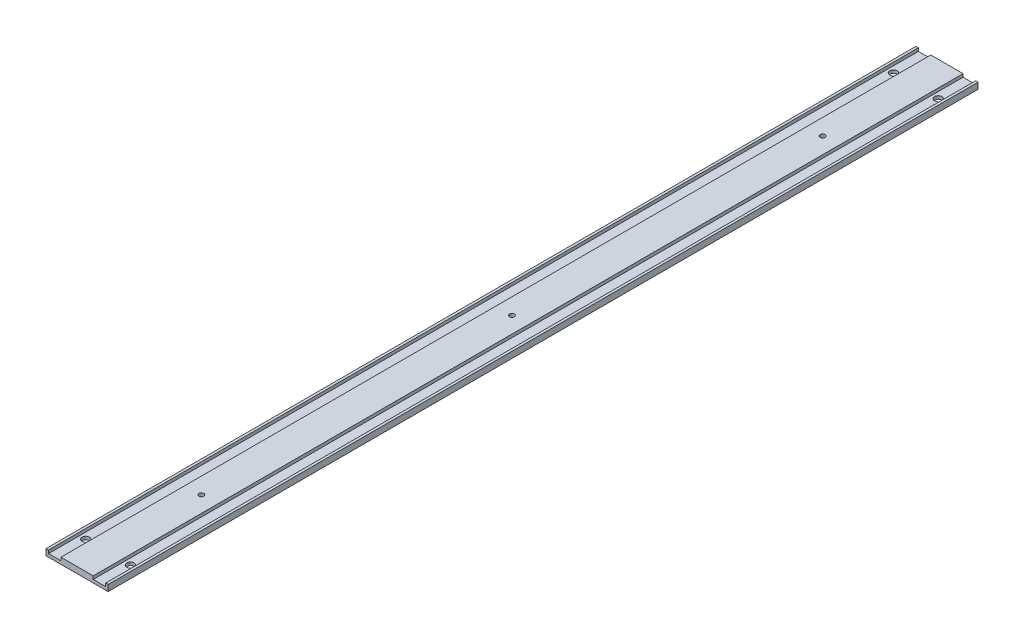
ISO-10303-21;
HEADER;
FILE_DESCRIPTION(('STEP AP214'),'2;1');
FILE_NAME('part.step','',(''),(''),'','','');
FILE_SCHEMA(('AUTOMOTIVE_DESIGN { 1 0 10303 214 1 1 1 1 }'));
ENDSEC;
DATA;
#1=APPLICATION_CONTEXT('core data for automotive mechanical design processes');
#2=APPLICATION_PROTOCOL_DEFINITION('international standard','automotive_design',2000,#1);
#3=PRODUCT_CONTEXT('',#1,'mechanical');
#4=PRODUCT('Part','Part','',(#3));
#5=PRODUCT_RELATED_PRODUCT_CATEGORY('part','',(#4));
#6=PRODUCT_DEFINITION_FORMATION('','',#4);
#7=PRODUCT_DEFINITION_CONTEXT('part definition',#1,'design');
#8=PRODUCT_DEFINITION('design','',#6,#7);
#9=PRODUCT_DEFINITION_SHAPE('','',#8);
#10=(LENGTH_UNIT() NAMED_UNIT(*) SI_UNIT(.MILLI.,.METRE.));
#11=(NAMED_UNIT(*) PLANE_ANGLE_UNIT() SI_UNIT($,.RADIAN.));
#12=(NAMED_UNIT(*) SI_UNIT($,.STERADIAN.) SOLID_ANGLE_UNIT());
#13=UNCERTAINTY_MEASURE_WITH_UNIT(LENGTH_MEASURE(1.E-05),#10,'distance_accuracy_value','');
#14=(GEOMETRIC_REPRESENTATION_CONTEXT(3) GLOBAL_UNCERTAINTY_ASSIGNED_CONTEXT((#13)) GLOBAL_UNIT_ASSIGNED_CONTEXT((#10,
#11,#12)) REPRESENTATION_CONTEXT('',''));
#15=CARTESIAN_POINT('',(0.,0.,0.));
#16=DIRECTION('',(0.,0.,1.));
#17=DIRECTION('',(1.,0.,0.));
#18=AXIS2_PLACEMENT_3D('',#15,#16,#17);
#19=CARTESIAN_POINT('',(0.,5.,0.));
#20=DIRECTION('',(0.,1.,0.));
#21=DIRECTION('',(0.,0.,1.));
#22=AXIS2_PLACEMENT_3D('',#19,#20,#21);
#23=PLANE('',#22);
#24=DIRECTION('',(0.,0.,-1.));
#25=VECTOR('',#24,1.);
#26=CARTESIAN_POINT('',(12.,5.,0.));
#27=LINE('',#26,#25);
#28=CARTESIAN_POINT('',(12.,5.,0.));
#29=VERTEX_POINT('',#28);
#30=CARTESIAN_POINT('',(12.,5.,-700.));
#31=VERTEX_POINT('',#30);
#32=EDGE_CURVE('E135',#29,#31,#27,.T.);
#33=ORIENTED_EDGE('',*,*,#32,.F.);
#34=DIRECTION('',(1.,0.,0.));
#35=VECTOR('',#34,1.);
#36=CARTESIAN_POINT('',(0.,5.,0.));
#37=LINE('',#36,#35);
#38=CARTESIAN_POINT('',(38.,5.,0.));
#39=VERTEX_POINT('',#38);
#40=EDGE_CURVE('E248',#29,#39,#37,.T.);
#41=ORIENTED_EDGE('',*,*,#40,.T.);
#42=DIRECTION('',(0.,0.,1.));
#43=VECTOR('',#42,1.);
#44=CARTESIAN_POINT('',(38.,5.,-700.));
#45=LINE('',#44,#43);
#46=CARTESIAN_POINT('',(38.,5.,-700.));
#47=VERTEX_POINT('',#46);
#48=EDGE_CURVE('E197',#47,#39,#45,.T.);
#49=ORIENTED_EDGE('',*,*,#48,.F.);
#50=DIRECTION('',(-1.,0.,0.));
#51=VECTOR('',#50,1.);
#52=CARTESIAN_POINT('',(50.,5.,-700.));
#53=LINE('',#52,#51);
#54=EDGE_CURVE('E257',#47,#31,#53,.T.);
#55=ORIENTED_EDGE('',*,*,#54,.T.);
#56=EDGE_LOOP('',(#33,#41,#49,#55));
#57=FACE_BOUND('',#56,.T.);
#58=CARTESIAN_POINT('',(25.,5.,-600.));
#59=DIRECTION('',(0.,1.,0.));
#60=DIRECTION('',(0.,0.,1.));
#61=AXIS2_PLACEMENT_3D('',#58,#59,#60);
#62=CIRCLE('',#61,2.);
#63=CARTESIAN_POINT('',(25.,5.,-598.));
#64=VERTEX_POINT('',#63);
#65=EDGE_CURVE('E218',#64,#64,#62,.T.);
#66=ORIENTED_EDGE('',*,*,#65,.F.);
#67=EDGE_LOOP('',(#66));
#68=FACE_BOUND('',#67,.T.);
#69=CARTESIAN_POINT('',(25.,5.,-350.));
#70=DIRECTION('',(0.,1.,0.));
#71=DIRECTION('',(0.,0.,1.));
#72=AXIS2_PLACEMENT_3D('',#69,#70,#71);
#73=CIRCLE('',#72,2.);
#74=CARTESIAN_POINT('',(25.,5.,-348.));
#75=VERTEX_POINT('',#74);
#76=EDGE_CURVE('E226',#75,#75,#73,.T.);
#77=ORIENTED_EDGE('',*,*,#76,.F.);
#78=EDGE_LOOP('',(#77));
#79=FACE_BOUND('',#78,.T.);
#80=CARTESIAN_POINT('',(25.,5.,-100.));
#81=DIRECTION('',(0.,1.,0.));
#82=DIRECTION('',(0.,0.,1.));
#83=AXIS2_PLACEMENT_3D('',#80,#81,#82);
#84=CIRCLE('',#83,2.);
#85=CARTESIAN_POINT('',(25.,5.,-98.));
#86=VERTEX_POINT('',#85);
#87=EDGE_CURVE('E172',#86,#86,#84,.T.);
#88=ORIENTED_EDGE('',*,*,#87,.F.);
#89=EDGE_LOOP('',(#88));
#90=FACE_BOUND('',#89,.T.);
#91=ADVANCED_FACE('F38',(#57,#68,#79,#90),#23,.T.);
#92=DIRECTION('',(0.,0.,1.));
#93=VECTOR('',#92,1.);
#94=CARTESIAN_POINT('',(2.,5.,-700.));
#95=LINE('',#94,#93);
#96=CARTESIAN_POINT('',(2.,5.,-700.));
#97=VERTEX_POINT('',#96);
#98=CARTESIAN_POINT('',(2.,5.,0.));
#99=VERTEX_POINT('',#98);
#100=EDGE_CURVE('E151',#97,#99,#95,.T.);
#101=ORIENTED_EDGE('',*,*,#100,.F.);
#102=CARTESIAN_POINT('',(0.,5.,-700.));
#103=VERTEX_POINT('',#102);
#104=EDGE_CURVE('E251',#97,#103,#53,.T.);
#105=ORIENTED_EDGE('',*,*,#104,.T.);
#106=DIRECTION('',(0.,0.,1.));
#107=VECTOR('',#106,1.);
#108=CARTESIAN_POINT('',(0.,5.,-700.));
#109=LINE('',#108,#107);
#110=CARTESIAN_POINT('',(0.,5.,0.));
#111=VERTEX_POINT('',#110);
#112=EDGE_CURVE('E237',#103,#111,#109,.T.);
#113=ORIENTED_EDGE('',*,*,#112,.T.);
#114=EDGE_CURVE('E243',#111,#99,#37,.T.);
#115=ORIENTED_EDGE('',*,*,#114,.T.);
#116=EDGE_LOOP('',(#101,#105,#113,#115));
#117=FACE_BOUND('',#116,.T.);
#118=ADVANCED_FACE('F323',(#117),#23,.T.);
#119=CARTESIAN_POINT('',(0.,5.,-700.));
#120=DIRECTION('',(1.,0.,0.));
#121=DIRECTION('',(0.,0.,-1.));
#122=AXIS2_PLACEMENT_3D('',#119,#120,#121);
#123=PLANE('',#122);
#124=DIRECTION('',(0.,0.,1.));
#125=VECTOR('',#124,1.);
#126=CARTESIAN_POINT('',(0.,0.,-700.));
#127=LINE('',#126,#125);
#128=CARTESIAN_POINT('',(0.,0.,-700.));
#129=VERTEX_POINT('',#128);
#130=CARTESIAN_POINT('',(0.,0.,0.));
#131=VERTEX_POINT('',#130);
#132=EDGE_CURVE('E217',#129,#131,#127,.T.);
#133=ORIENTED_EDGE('',*,*,#132,.T.);
#134=DIRECTION('',(0.,-1.,0.));
#135=VECTOR('',#134,1.);
#136=CARTESIAN_POINT('',(0.,5.,0.));
#137=LINE('',#136,#135);
#138=EDGE_CURVE('E11',#111,#131,#137,.T.);
#139=ORIENTED_EDGE('',*,*,#138,.F.);
#140=ORIENTED_EDGE('',*,*,#112,.F.);
#141=DIRECTION('',(0.,-1.,0.));
#142=VECTOR('',#141,1.);
#143=CARTESIAN_POINT('',(0.,5.,-700.));
#144=LINE('',#143,#142);
#145=EDGE_CURVE('E256',#103,#129,#144,.T.);
#146=ORIENTED_EDGE('',*,*,#145,.T.);
#147=EDGE_LOOP('',(#133,#139,#140,#146));
#148=FACE_BOUND('',#147,.T.);
#149=ADVANCED_FACE('F40',(#148),#123,.F.);
#150=CARTESIAN_POINT('',(0.,5.,0.));
#151=DIRECTION('',(0.,0.,-1.));
#152=DIRECTION('',(-1.,0.,0.));
#153=AXIS2_PLACEMENT_3D('',#150,#151,#152);
#154=PLANE('',#153);
#155=ORIENTED_EDGE('',*,*,#40,.F.);
#156=DIRECTION('',(0.,1.,0.));
#157=VECTOR('',#156,1.);
#158=CARTESIAN_POINT('',(12.,2.5,0.));
#159=LINE('',#158,#157);
#160=CARTESIAN_POINT('',(12.,2.5,0.));
#161=VERTEX_POINT('',#160);
#162=EDGE_CURVE('E169',#161,#29,#159,.T.);
#163=ORIENTED_EDGE('',*,*,#162,.F.);
#164=DIRECTION('',(1.,0.,0.));
#165=VECTOR('',#164,1.);
#166=CARTESIAN_POINT('',(12.,2.5,0.));
#167=LINE('',#166,#165);
#168=CARTESIAN_POINT('',(2.,2.5,0.));
#169=VERTEX_POINT('',#168);
#170=EDGE_CURVE('E141',#169,#161,#167,.T.);
#171=ORIENTED_EDGE('',*,*,#170,.F.);
#172=DIRECTION('',(0.,1.,0.));
#173=VECTOR('',#172,1.);
#174=CARTESIAN_POINT('',(2.,2.5,0.));
#175=LINE('',#174,#173);
#176=EDGE_CURVE('E173',#169,#99,#175,.T.);
#177=ORIENTED_EDGE('',*,*,#176,.T.);
#178=ORIENTED_EDGE('',*,*,#114,.F.);
#179=ORIENTED_EDGE('',*,*,#138,.T.);
#180=DIRECTION('',(1.,0.,0.));
#181=VECTOR('',#180,1.);
#182=CARTESIAN_POINT('',(0.,0.,0.));
#183=LINE('',#182,#181);
#184=CARTESIAN_POINT('',(50.,0.,0.));
#185=VERTEX_POINT('',#184);
#186=EDGE_CURVE('E261',#131,#185,#183,.T.);
#187=ORIENTED_EDGE('',*,*,#186,.T.);
#188=DIRECTION('',(0.,-1.,0.));
#189=VECTOR('',#188,1.);
#190=CARTESIAN_POINT('',(50.,5.,0.));
#191=LINE('',#190,#189);
#192=CARTESIAN_POINT('',(50.,5.,0.));
#193=VERTEX_POINT('',#192);
#194=EDGE_CURVE('E48',#193,#185,#191,.T.);
#195=ORIENTED_EDGE('',*,*,#194,.F.);
#196=CARTESIAN_POINT('',(48.,5.,0.));
#197=VERTEX_POINT('',#196);
#198=EDGE_CURVE('E241',#197,#193,#37,.T.);
#199=ORIENTED_EDGE('',*,*,#198,.F.);
#200=DIRECTION('',(0.,1.,0.));
#201=VECTOR('',#200,1.);
#202=CARTESIAN_POINT('',(48.,2.5,0.));
#203=LINE('',#202,#201);
#204=CARTESIAN_POINT('',(48.,2.5,0.));
#205=VERTEX_POINT('',#204);
#206=EDGE_CURVE('E64',#205,#197,#203,.T.);
#207=ORIENTED_EDGE('',*,*,#206,.F.);
#208=DIRECTION('',(1.,0.,0.));
#209=VECTOR('',#208,1.);
#210=CARTESIAN_POINT('',(38.,2.5,0.));
#211=LINE('',#210,#209);
#212=CARTESIAN_POINT('',(38.,2.5,0.));
#213=VERTEX_POINT('',#212);
#214=EDGE_CURVE('E183',#213,#205,#211,.T.);
#215=ORIENTED_EDGE('',*,*,#214,.F.);
#216=DIRECTION('',(0.,1.,0.));
#217=VECTOR('',#216,1.);
#218=CARTESIAN_POINT('',(38.,2.5,0.));
#219=LINE('',#218,#217);
#220=EDGE_CURVE('E196',#213,#39,#219,.T.);
#221=ORIENTED_EDGE('',*,*,#220,.T.);
#222=EDGE_LOOP('',(#155,#163,#171,#177,#178,#179,#187,#195,#199,#207,#215,#221));
#223=FACE_BOUND('',#222,.T.);
#224=ADVANCED_FACE('F311',(#223),#154,.F.);
#225=CARTESIAN_POINT('',(50.,5.,0.));
#226=DIRECTION('',(-1.,0.,0.));
#227=DIRECTION('',(0.,0.,1.));
#228=AXIS2_PLACEMENT_3D('',#225,#226,#227);
#229=PLANE('',#228);
#230=DIRECTION('',(0.,0.,-1.));
#231=VECTOR('',#230,1.);
#232=CARTESIAN_POINT('',(50.,0.,0.));
#233=LINE('',#232,#231);
#234=CARTESIAN_POINT('',(50.,0.,-700.));
#235=VERTEX_POINT('',#234);
#236=EDGE_CURVE('E264',#185,#235,#233,.T.);
#237=ORIENTED_EDGE('',*,*,#236,.T.);
#238=DIRECTION('',(0.,-1.,0.));
#239=VECTOR('',#238,1.);
#240=CARTESIAN_POINT('',(50.,5.,-700.));
#241=LINE('',#240,#239);
#242=CARTESIAN_POINT('',(50.,5.,-700.));
#243=VERTEX_POINT('',#242);
#244=EDGE_CURVE('E272',#243,#235,#241,.T.);
#245=ORIENTED_EDGE('',*,*,#244,.F.);
#246=DIRECTION('',(0.,0.,-1.));
#247=VECTOR('',#246,1.);
#248=CARTESIAN_POINT('',(50.,5.,0.));
#249=LINE('',#248,#247);
#250=EDGE_CURVE('E247',#193,#243,#249,.T.);
#251=ORIENTED_EDGE('',*,*,#250,.F.);
#252=ORIENTED_EDGE('',*,*,#194,.T.);
#253=EDGE_LOOP('',(#237,#245,#251,#252));
#254=FACE_BOUND('',#253,.T.);
#255=ADVANCED_FACE('F332',(#254),#229,.F.);
#256=CARTESIAN_POINT('',(50.,5.,-700.));
#257=DIRECTION('',(0.,0.,1.));
#258=DIRECTION('',(1.,0.,0.));
#259=AXIS2_PLACEMENT_3D('',#256,#257,#258);
#260=PLANE('',#259);
#261=DIRECTION('',(-1.,0.,0.));
#262=VECTOR('',#261,1.);
#263=CARTESIAN_POINT('',(2.,2.5,-700.));
#264=LINE('',#263,#262);
#265=CARTESIAN_POINT('',(12.,2.5,-700.));
#266=VERTEX_POINT('',#265);
#267=CARTESIAN_POINT('',(2.,2.5,-700.));
#268=VERTEX_POINT('',#267);
#269=EDGE_CURVE('E147',#266,#268,#264,.T.);
#270=ORIENTED_EDGE('',*,*,#269,.F.);
#271=DIRECTION('',(0.,1.,0.));
#272=VECTOR('',#271,1.);
#273=CARTESIAN_POINT('',(12.,2.5,-700.));
#274=LINE('',#273,#272);
#275=EDGE_CURVE('E129',#266,#31,#274,.T.);
#276=ORIENTED_EDGE('',*,*,#275,.T.);
#277=ORIENTED_EDGE('',*,*,#54,.F.);
#278=DIRECTION('',(0.,1.,0.));
#279=VECTOR('',#278,1.);
#280=CARTESIAN_POINT('',(38.,2.5,-700.));
#281=LINE('',#280,#279);
#282=CARTESIAN_POINT('',(38.,2.5,-700.));
#283=VERTEX_POINT('',#282);
#284=EDGE_CURVE('E166',#283,#47,#281,.T.);
#285=ORIENTED_EDGE('',*,*,#284,.F.);
#286=DIRECTION('',(-1.,0.,0.));
#287=VECTOR('',#286,1.);
#288=CARTESIAN_POINT('',(38.,2.5,-700.));
#289=LINE('',#288,#287);
#290=CARTESIAN_POINT('',(48.,2.5,-700.));
#291=VERTEX_POINT('',#290);
#292=EDGE_CURVE('E192',#291,#283,#289,.T.);
#293=ORIENTED_EDGE('',*,*,#292,.F.);
#294=DIRECTION('',(0.,1.,0.));
#295=VECTOR('',#294,1.);
#296=CARTESIAN_POINT('',(48.,2.5,-700.));
#297=LINE('',#296,#295);
#298=CARTESIAN_POINT('',(48.,5.,-700.));
#299=VERTEX_POINT('',#298);
#300=EDGE_CURVE('E204',#291,#299,#297,.T.);
#301=ORIENTED_EDGE('',*,*,#300,.T.);
#302=EDGE_CURVE('E252',#243,#299,#53,.T.);
#303=ORIENTED_EDGE('',*,*,#302,.F.);
#304=ORIENTED_EDGE('',*,*,#244,.T.);
#305=DIRECTION('',(-1.,0.,0.));
#306=VECTOR('',#305,1.);
#307=CARTESIAN_POINT('',(50.,0.,-700.));
#308=LINE('',#307,#306);
#309=EDGE_CURVE('E242',#235,#129,#308,.T.);
#310=ORIENTED_EDGE('',*,*,#309,.T.);
#311=ORIENTED_EDGE('',*,*,#145,.F.);
#312=ORIENTED_EDGE('',*,*,#104,.F.);
#313=DIRECTION('',(0.,1.,0.));
#314=VECTOR('',#313,1.);
#315=CARTESIAN_POINT('',(2.,2.5,-700.));
#316=LINE('',#315,#314);
#317=EDGE_CURVE('E56',#268,#97,#316,.T.);
#318=ORIENTED_EDGE('',*,*,#317,.F.);
#319=EDGE_LOOP('',(#270,#276,#277,#285,#293,#301,#303,#304,#310,#311,#312,#318));
#320=FACE_BOUND('',#319,.T.);
#321=ADVANCED_FACE('F153',(#320),#260,.F.);
#322=DIRECTION('',(0.,0.,-1.));
#323=VECTOR('',#322,1.);
#324=CARTESIAN_POINT('',(48.,5.,0.));
#325=LINE('',#324,#323);
#326=EDGE_CURVE('E184',#197,#299,#325,.T.);
#327=ORIENTED_EDGE('',*,*,#326,.F.);
#328=ORIENTED_EDGE('',*,*,#198,.T.);
#329=ORIENTED_EDGE('',*,*,#250,.T.);
#330=ORIENTED_EDGE('',*,*,#302,.T.);
#331=EDGE_LOOP('',(#327,#328,#329,#330));
#332=FACE_BOUND('',#331,.T.);
#333=ADVANCED_FACE('F337',(#332),#23,.T.);
#334=CARTESIAN_POINT('',(0.,0.,0.));
#335=DIRECTION('',(0.,1.,0.));
#336=DIRECTION('',(0.,0.,1.));
#337=AXIS2_PLACEMENT_3D('',#334,#335,#336);
#338=PLANE('',#337);
#339=CARTESIAN_POINT('',(7.,0.,-25.));
#340=DIRECTION('',(0.,1.,0.));
#341=DIRECTION('',(0.,0.,1.));
#342=AXIS2_PLACEMENT_3D('',#339,#340,#341);
#343=CIRCLE('',#342,3.);
#344=CARTESIAN_POINT('',(7.,0.,-22.));
#345=VERTEX_POINT('',#344);
#346=EDGE_CURVE('E486',#345,#345,#343,.T.);
#347=ORIENTED_EDGE('',*,*,#346,.T.);
#348=EDGE_LOOP('',(#347));
#349=FACE_BOUND('',#348,.T.);
#350=CARTESIAN_POINT('',(43.,0.,-675.));
#351=DIRECTION('',(0.,1.,0.));
#352=DIRECTION('',(0.,0.,1.));
#353=AXIS2_PLACEMENT_3D('',#350,#351,#352);
#354=CIRCLE('',#353,3.);
#355=CARTESIAN_POINT('',(43.,0.,-672.));
#356=VERTEX_POINT('',#355);
#357=EDGE_CURVE('E489',#356,#356,#354,.T.);
#358=ORIENTED_EDGE('',*,*,#357,.T.);
#359=EDGE_LOOP('',(#358));
#360=FACE_BOUND('',#359,.T.);
#361=CARTESIAN_POINT('',(7.,0.,-675.));
#362=DIRECTION('',(0.,1.,0.));
#363=DIRECTION('',(0.,0.,1.));
#364=AXIS2_PLACEMENT_3D('',#361,#362,#363);
#365=CIRCLE('',#364,3.);
#366=CARTESIAN_POINT('',(7.,0.,-672.));
#367=VERTEX_POINT('',#366);
#368=EDGE_CURVE('E494',#367,#367,#365,.T.);
#369=ORIENTED_EDGE('',*,*,#368,.T.);
#370=EDGE_LOOP('',(#369));
#371=FACE_BOUND('',#370,.T.);
#372=CARTESIAN_POINT('',(43.,0.,-25.));
#373=DIRECTION('',(0.,1.,0.));
#374=DIRECTION('',(0.,0.,1.));
#375=AXIS2_PLACEMENT_3D('',#372,#373,#374);
#376=CIRCLE('',#375,3.);
#377=CARTESIAN_POINT('',(43.,0.,-22.));
#378=VERTEX_POINT('',#377);
#379=EDGE_CURVE('E284',#378,#378,#376,.T.);
#380=ORIENTED_EDGE('',*,*,#379,.T.);
#381=EDGE_LOOP('',(#380));
#382=FACE_BOUND('',#381,.T.);
#383=CARTESIAN_POINT('',(25.,0.,-600.));
#384=DIRECTION('',(0.,1.,0.));
#385=DIRECTION('',(0.,0.,1.));
#386=AXIS2_PLACEMENT_3D('',#383,#384,#385);
#387=CIRCLE('',#386,2.);
#388=CARTESIAN_POINT('',(25.,0.,-598.));
#389=VERTEX_POINT('',#388);
#390=EDGE_CURVE('E213',#389,#389,#387,.T.);
#391=ORIENTED_EDGE('',*,*,#390,.T.);
#392=EDGE_LOOP('',(#391));
#393=FACE_BOUND('',#392,.T.);
#394=CARTESIAN_POINT('',(25.,0.,-350.));
#395=DIRECTION('',(0.,1.,0.));
#396=DIRECTION('',(0.,0.,1.));
#397=AXIS2_PLACEMENT_3D('',#394,#395,#396);
#398=CIRCLE('',#397,2.);
#399=CARTESIAN_POINT('',(25.,0.,-348.));
#400=VERTEX_POINT('',#399);
#401=EDGE_CURVE('E222',#400,#400,#398,.T.);
#402=ORIENTED_EDGE('',*,*,#401,.T.);
#403=EDGE_LOOP('',(#402));
#404=FACE_BOUND('',#403,.T.);
#405=CARTESIAN_POINT('',(25.,0.,-100.));
#406=DIRECTION('',(0.,1.,0.));
#407=DIRECTION('',(0.,0.,1.));
#408=AXIS2_PLACEMENT_3D('',#405,#406,#407);
#409=CIRCLE('',#408,2.);
#410=CARTESIAN_POINT('',(25.,0.,-98.));
#411=VERTEX_POINT('',#410);
#412=EDGE_CURVE('E230',#411,#411,#409,.T.);
#413=ORIENTED_EDGE('',*,*,#412,.T.);
#414=EDGE_LOOP('',(#413));
#415=FACE_BOUND('',#414,.T.);
#416=ORIENTED_EDGE('',*,*,#132,.F.);
#417=ORIENTED_EDGE('',*,*,#309,.F.);
#418=ORIENTED_EDGE('',*,*,#236,.F.);
#419=ORIENTED_EDGE('',*,*,#186,.F.);
#420=EDGE_LOOP('',(#416,#417,#418,#419));
#421=FACE_BOUND('',#420,.T.);
#422=ADVANCED_FACE('F335',(#349,#360,#371,#382,#393,#404,#415,#421),#338,.F.);
#423=CARTESIAN_POINT('',(25.,0.,-100.));
#424=DIRECTION('',(0.,1.,0.));
#425=DIRECTION('',(0.,0.,1.));
#426=AXIS2_PLACEMENT_3D('',#423,#424,#425);
#427=CYLINDRICAL_SURFACE('',#426,2.);
#428=ORIENTED_EDGE('',*,*,#412,.F.);
#429=EDGE_LOOP('',(#428));
#430=FACE_BOUND('',#429,.T.);
#431=ORIENTED_EDGE('',*,*,#87,.T.);
#432=EDGE_LOOP('',(#431));
#433=FACE_BOUND('',#432,.T.);
#434=ADVANCED_FACE('F363',(#430,#433),#427,.F.);
#435=CARTESIAN_POINT('',(25.,0.,-350.));
#436=DIRECTION('',(0.,1.,0.));
#437=DIRECTION('',(0.,0.,1.));
#438=AXIS2_PLACEMENT_3D('',#435,#436,#437);
#439=CYLINDRICAL_SURFACE('',#438,2.);
#440=ORIENTED_EDGE('',*,*,#401,.F.);
#441=EDGE_LOOP('',(#440));
#442=FACE_BOUND('',#441,.T.);
#443=ORIENTED_EDGE('',*,*,#76,.T.);
#444=EDGE_LOOP('',(#443));
#445=FACE_BOUND('',#444,.T.);
#446=ADVANCED_FACE('F347',(#442,#445),#439,.F.);
#447=CARTESIAN_POINT('',(25.,0.,-600.));
#448=DIRECTION('',(0.,1.,0.));
#449=DIRECTION('',(0.,0.,1.));
#450=AXIS2_PLACEMENT_3D('',#447,#448,#449);
#451=CYLINDRICAL_SURFACE('',#450,2.);
#452=ORIENTED_EDGE('',*,*,#390,.F.);
#453=EDGE_LOOP('',(#452));
#454=FACE_BOUND('',#453,.T.);
#455=ORIENTED_EDGE('',*,*,#65,.T.);
#456=EDGE_LOOP('',(#455));
#457=FACE_BOUND('',#456,.T.);
#458=ADVANCED_FACE('F340',(#454,#457),#451,.F.);
#459=CARTESIAN_POINT('',(38.,2.5,-700.));
#460=DIRECTION('',(-1.,0.,0.));
#461=DIRECTION('',(0.,0.,1.));
#462=AXIS2_PLACEMENT_3D('',#459,#460,#461);
#463=PLANE('',#462);
#464=ORIENTED_EDGE('',*,*,#48,.T.);
#465=ORIENTED_EDGE('',*,*,#220,.F.);
#466=DIRECTION('',(0.,0.,1.));
#467=VECTOR('',#466,1.);
#468=CARTESIAN_POINT('',(38.,2.5,-700.));
#469=LINE('',#468,#467);
#470=EDGE_CURVE('E179',#283,#213,#469,.T.);
#471=ORIENTED_EDGE('',*,*,#470,.F.);
#472=ORIENTED_EDGE('',*,*,#284,.T.);
#473=EDGE_LOOP('',(#464,#465,#471,#472));
#474=FACE_BOUND('',#473,.T.);
#475=ADVANCED_FACE('F338',(#474),#463,.F.);
#476=CARTESIAN_POINT('',(48.,2.5,0.));
#477=DIRECTION('',(1.,0.,0.));
#478=DIRECTION('',(0.,0.,-1.));
#479=AXIS2_PLACEMENT_3D('',#476,#477,#478);
#480=PLANE('',#479);
#481=ORIENTED_EDGE('',*,*,#326,.T.);
#482=ORIENTED_EDGE('',*,*,#300,.F.);
#483=DIRECTION('',(0.,0.,-1.));
#484=VECTOR('',#483,1.);
#485=CARTESIAN_POINT('',(48.,2.5,0.));
#486=LINE('',#485,#484);
#487=EDGE_CURVE('E188',#205,#291,#486,.T.);
#488=ORIENTED_EDGE('',*,*,#487,.F.);
#489=ORIENTED_EDGE('',*,*,#206,.T.);
#490=EDGE_LOOP('',(#481,#482,#488,#489));
#491=FACE_BOUND('',#490,.T.);
#492=ADVANCED_FACE('F302',(#491),#480,.F.);
#493=CARTESIAN_POINT('',(0.,2.5,0.));
#494=DIRECTION('',(0.,1.,0.));
#495=DIRECTION('',(0.,0.,1.));
#496=AXIS2_PLACEMENT_3D('',#493,#494,#495);
#497=PLANE('',#496);
#498=CARTESIAN_POINT('',(43.,2.5,-675.));
#499=DIRECTION('',(0.,1.,0.));
#500=DIRECTION('',(0.,0.,1.));
#501=AXIS2_PLACEMENT_3D('',#498,#499,#500);
#502=CIRCLE('',#501,3.);
#503=CARTESIAN_POINT('',(43.,2.5,-672.));
#504=VERTEX_POINT('',#503);
#505=EDGE_CURVE('E42',#504,#504,#502,.T.);
#506=ORIENTED_EDGE('',*,*,#505,.F.);
#507=EDGE_LOOP('',(#506));
#508=FACE_BOUND('',#507,.T.);
#509=CARTESIAN_POINT('',(43.,2.5,-25.));
#510=DIRECTION('',(0.,1.,0.));
#511=DIRECTION('',(0.,0.,1.));
#512=AXIS2_PLACEMENT_3D('',#509,#510,#511);
#513=CIRCLE('',#512,3.);
#514=CARTESIAN_POINT('',(43.,2.5,-22.));
#515=VERTEX_POINT('',#514);
#516=EDGE_CURVE('E287',#515,#515,#513,.T.);
#517=ORIENTED_EDGE('',*,*,#516,.F.);
#518=EDGE_LOOP('',(#517));
#519=FACE_BOUND('',#518,.T.);
#520=ORIENTED_EDGE('',*,*,#470,.T.);
#521=ORIENTED_EDGE('',*,*,#214,.T.);
#522=ORIENTED_EDGE('',*,*,#487,.T.);
#523=ORIENTED_EDGE('',*,*,#292,.T.);
#524=EDGE_LOOP('',(#520,#521,#522,#523));
#525=FACE_BOUND('',#524,.T.);
#526=ADVANCED_FACE('F299',(#508,#519,#525),#497,.T.);
#527=CARTESIAN_POINT('',(12.,2.5,0.));
#528=DIRECTION('',(1.,0.,0.));
#529=DIRECTION('',(0.,0.,-1.));
#530=AXIS2_PLACEMENT_3D('',#527,#528,#529);
#531=PLANE('',#530);
#532=ORIENTED_EDGE('',*,*,#32,.T.);
#533=ORIENTED_EDGE('',*,*,#275,.F.);
#534=DIRECTION('',(0.,0.,-1.));
#535=VECTOR('',#534,1.);
#536=CARTESIAN_POINT('',(12.,2.5,0.));
#537=LINE('',#536,#535);
#538=EDGE_CURVE('E132',#161,#266,#537,.T.);
#539=ORIENTED_EDGE('',*,*,#538,.F.);
#540=ORIENTED_EDGE('',*,*,#162,.T.);
#541=EDGE_LOOP('',(#532,#533,#539,#540));
#542=FACE_BOUND('',#541,.T.);
#543=ADVANCED_FACE('F131',(#542),#531,.F.);
#544=CARTESIAN_POINT('',(2.,2.5,-700.));
#545=DIRECTION('',(-1.,0.,0.));
#546=DIRECTION('',(0.,0.,1.));
#547=AXIS2_PLACEMENT_3D('',#544,#545,#546);
#548=PLANE('',#547);
#549=ORIENTED_EDGE('',*,*,#100,.T.);
#550=ORIENTED_EDGE('',*,*,#176,.F.);
#551=DIRECTION('',(0.,0.,1.));
#552=VECTOR('',#551,1.);
#553=CARTESIAN_POINT('',(2.,2.5,-700.));
#554=LINE('',#553,#552);
#555=EDGE_CURVE('E156',#268,#169,#554,.T.);
#556=ORIENTED_EDGE('',*,*,#555,.F.);
#557=ORIENTED_EDGE('',*,*,#317,.T.);
#558=EDGE_LOOP('',(#549,#550,#556,#557));
#559=FACE_BOUND('',#558,.T.);
#560=ADVANCED_FACE('F420',(#559),#548,.F.);
#561=CARTESIAN_POINT('',(0.,2.5,0.));
#562=DIRECTION('',(0.,-1.,0.));
#563=DIRECTION('',(0.,0.,-1.));
#564=AXIS2_PLACEMENT_3D('',#561,#562,#563);
#565=PLANE('',#564);
#566=CARTESIAN_POINT('',(7.,2.5,-25.));
#567=DIRECTION('',(0.,-1.,0.));
#568=DIRECTION('',(0.,0.,-1.));
#569=AXIS2_PLACEMENT_3D('',#566,#567,#568);
#570=CIRCLE('',#569,3.);
#571=CARTESIAN_POINT('',(7.,2.5,-28.));
#572=VERTEX_POINT('',#571);
#573=EDGE_CURVE('E283',#572,#572,#570,.T.);
#574=ORIENTED_EDGE('',*,*,#573,.T.);
#575=EDGE_LOOP('',(#574));
#576=FACE_BOUND('',#575,.T.);
#577=CARTESIAN_POINT('',(7.,2.5,-675.));
#578=DIRECTION('',(0.,-1.,0.));
#579=DIRECTION('',(0.,0.,-1.));
#580=AXIS2_PLACEMENT_3D('',#577,#578,#579);
#581=CIRCLE('',#580,3.);
#582=CARTESIAN_POINT('',(7.,2.5,-678.));
#583=VERTEX_POINT('',#582);
#584=EDGE_CURVE('E279',#583,#583,#581,.T.);
#585=ORIENTED_EDGE('',*,*,#584,.T.);
#586=EDGE_LOOP('',(#585));
#587=FACE_BOUND('',#586,.T.);
#588=ORIENTED_EDGE('',*,*,#538,.T.);
#589=ORIENTED_EDGE('',*,*,#269,.T.);
#590=ORIENTED_EDGE('',*,*,#555,.T.);
#591=ORIENTED_EDGE('',*,*,#170,.T.);
#592=EDGE_LOOP('',(#588,#589,#590,#591));
#593=FACE_BOUND('',#592,.T.);
#594=ADVANCED_FACE('F145',(#576,#587,#593),#565,.F.);
#595=CARTESIAN_POINT('',(7.,0.,-675.));
#596=DIRECTION('',(0.,1.,0.));
#597=DIRECTION('',(0.,0.,1.));
#598=AXIS2_PLACEMENT_3D('',#595,#596,#597);
#599=CYLINDRICAL_SURFACE('',#598,3.);
#600=ORIENTED_EDGE('',*,*,#368,.F.);
#601=EDGE_LOOP('',(#600));
#602=FACE_BOUND('',#601,.T.);
#603=ORIENTED_EDGE('',*,*,#584,.F.);
#604=EDGE_LOOP('',(#603));
#605=FACE_BOUND('',#604,.T.);
#606=ADVANCED_FACE('F442',(#602,#605),#599,.F.);
#607=CARTESIAN_POINT('',(7.,0.,-25.));
#608=DIRECTION('',(0.,1.,0.));
#609=DIRECTION('',(0.,0.,1.));
#610=AXIS2_PLACEMENT_3D('',#607,#608,#609);
#611=CYLINDRICAL_SURFACE('',#610,3.);
#612=ORIENTED_EDGE('',*,*,#346,.F.);
#613=EDGE_LOOP('',(#612));
#614=FACE_BOUND('',#613,.T.);
#615=ORIENTED_EDGE('',*,*,#573,.F.);
#616=EDGE_LOOP('',(#615));
#617=FACE_BOUND('',#616,.T.);
#618=ADVANCED_FACE('F450',(#614,#617),#611,.F.);
#619=CARTESIAN_POINT('',(43.,0.,-25.));
#620=DIRECTION('',(0.,1.,0.));
#621=DIRECTION('',(0.,0.,1.));
#622=AXIS2_PLACEMENT_3D('',#619,#620,#621);
#623=CYLINDRICAL_SURFACE('',#622,3.);
#624=ORIENTED_EDGE('',*,*,#516,.T.);
#625=EDGE_LOOP('',(#624));
#626=FACE_BOUND('',#625,.T.);
#627=ORIENTED_EDGE('',*,*,#379,.F.);
#628=EDGE_LOOP('',(#627));
#629=FACE_BOUND('',#628,.T.);
#630=ADVANCED_FACE('F460',(#626,#629),#623,.F.);
#631=CARTESIAN_POINT('',(43.,0.,-675.));
#632=DIRECTION('',(0.,1.,0.));
#633=DIRECTION('',(0.,0.,1.));
#634=AXIS2_PLACEMENT_3D('',#631,#632,#633);
#635=CYLINDRICAL_SURFACE('',#634,3.);
#636=ORIENTED_EDGE('',*,*,#505,.T.);
#637=EDGE_LOOP('',(#636));
#638=FACE_BOUND('',#637,.T.);
#639=ORIENTED_EDGE('',*,*,#357,.F.);
#640=EDGE_LOOP('',(#639));
#641=FACE_BOUND('',#640,.T.);
#642=ADVANCED_FACE('F296',(#638,#641),#635,.F.);
#643=CLOSED_SHELL('',(#91,#118,#149,#224,#255,#321,#333,#422,#434,#446,#458,#475,#492,#526,#543,
#560,#594,#606,#618,#630,#642));
#644=MANIFOLD_SOLID_BREP('B2',#643);
#645=ADVANCED_BREP_SHAPE_REPRESENTATION('',(#18,#644),#14);
#646=SHAPE_DEFINITION_REPRESENTATION(#9,#645);
ENDSEC;
END-ISO-10303-21;
